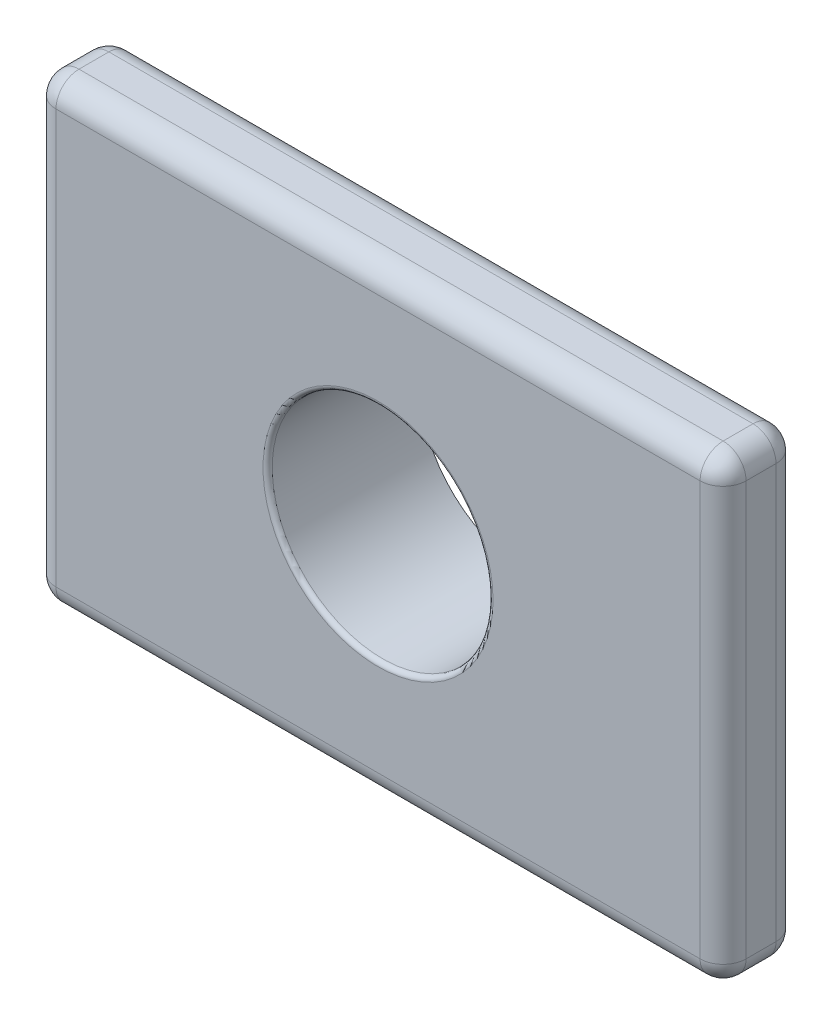
ISO-10303-21;
HEADER;
FILE_DESCRIPTION(('STEP AP214'),'2;1');
FILE_NAME('part.step','',(''),(''),'','','');
FILE_SCHEMA(('AUTOMOTIVE_DESIGN { 1 0 10303 214 1 1 1 1 }'));
ENDSEC;
DATA;
#1=APPLICATION_CONTEXT('core data for automotive mechanical design processes');
#2=APPLICATION_PROTOCOL_DEFINITION('international standard','automotive_design',2000,#1);
#3=PRODUCT_CONTEXT('',#1,'mechanical');
#4=PRODUCT('Part','Part','',(#3));
#5=PRODUCT_RELATED_PRODUCT_CATEGORY('part','',(#4));
#6=PRODUCT_DEFINITION_FORMATION('','',#4);
#7=PRODUCT_DEFINITION_CONTEXT('part definition',#1,'design');
#8=PRODUCT_DEFINITION('design','',#6,#7);
#9=PRODUCT_DEFINITION_SHAPE('','',#8);
#10=(LENGTH_UNIT() NAMED_UNIT(*) SI_UNIT(.MILLI.,.METRE.));
#11=(NAMED_UNIT(*) PLANE_ANGLE_UNIT() SI_UNIT($,.RADIAN.));
#12=(NAMED_UNIT(*) SI_UNIT($,.STERADIAN.) SOLID_ANGLE_UNIT());
#13=UNCERTAINTY_MEASURE_WITH_UNIT(LENGTH_MEASURE(1.E-05),#10,'distance_accuracy_value','');
#14=(GEOMETRIC_REPRESENTATION_CONTEXT(3) GLOBAL_UNCERTAINTY_ASSIGNED_CONTEXT((#13)) GLOBAL_UNIT_ASSIGNED_CONTEXT((#10,
#11,#12)) REPRESENTATION_CONTEXT('',''));
#15=CARTESIAN_POINT('',(0.,0.,0.));
#16=DIRECTION('',(0.,0.,1.));
#17=DIRECTION('',(1.,0.,0.));
#18=AXIS2_PLACEMENT_3D('',#15,#16,#17);
#19=CARTESIAN_POINT('',(0.,0.,0.));
#20=DIRECTION('',(0.,0.,1.));
#21=DIRECTION('',(1.,0.,0.));
#22=AXIS2_PLACEMENT_3D('',#19,#20,#21);
#23=PLANE('',#22);
#24=DIRECTION('',(0.,1.,0.));
#25=VECTOR('',#24,1.);
#26=CARTESIAN_POINT('',(14.5,0.,0.));
#27=LINE('',#26,#25);
#28=CARTESIAN_POINT('',(14.5,9.498,0.));
#29=VERTEX_POINT('',#28);
#30=CARTESIAN_POINT('',(14.5,0.5,0.));
#31=VERTEX_POINT('',#30);
#32=EDGE_CURVE('E284',#29,#31,#27,.F.);
#33=ORIENTED_EDGE('',*,*,#32,.T.);
#34=DIRECTION('',(1.,0.,0.));
#35=VECTOR('',#34,1.);
#36=CARTESIAN_POINT('',(0.,0.5,0.));
#37=LINE('',#36,#35);
#38=CARTESIAN_POINT('',(0.5,0.5,0.));
#39=VERTEX_POINT('',#38);
#40=EDGE_CURVE('E159',#31,#39,#37,.F.);
#41=ORIENTED_EDGE('',*,*,#40,.T.);
#42=DIRECTION('',(0.,1.,0.));
#43=VECTOR('',#42,1.);
#44=CARTESIAN_POINT('',(0.5,9.498,0.));
#45=LINE('',#44,#43);
#46=CARTESIAN_POINT('',(0.5,9.498,0.));
#47=VERTEX_POINT('',#46);
#48=EDGE_CURVE('E59',#39,#47,#45,.T.);
#49=ORIENTED_EDGE('',*,*,#48,.T.);
#50=DIRECTION('',(1.,0.,0.));
#51=VECTOR('',#50,1.);
#52=CARTESIAN_POINT('',(14.5,9.498,0.));
#53=LINE('',#52,#51);
#54=EDGE_CURVE('E286',#47,#29,#53,.T.);
#55=ORIENTED_EDGE('',*,*,#54,.T.);
#56=EDGE_LOOP('',(#33,#41,#49,#55));
#57=FACE_BOUND('',#56,.T.);
#58=CARTESIAN_POINT('',(7.5,4.999,0.));
#59=DIRECTION('',(0.,0.,1.));
#60=DIRECTION('',(1.,0.,0.));
#61=AXIS2_PLACEMENT_3D('',#58,#59,#60);
#62=CIRCLE('',#61,2.7);
#63=CARTESIAN_POINT('',(10.2,4.999,0.));
#64=VERTEX_POINT('',#63);
#65=EDGE_CURVE('E235',#64,#64,#62,.T.);
#66=ORIENTED_EDGE('',*,*,#65,.T.);
#67=EDGE_LOOP('',(#66));
#68=FACE_BOUND('',#67,.T.);
#69=ADVANCED_FACE('F34',(#57,#68),#23,.F.);
#70=CARTESIAN_POINT('',(0.,0.,1.65));
#71=DIRECTION('',(0.,1.,0.));
#72=DIRECTION('',(0.,0.,1.));
#73=AXIS2_PLACEMENT_3D('',#70,#71,#72);
#74=PLANE('',#73);
#75=DIRECTION('',(0.,0.,-1.));
#76=VECTOR('',#75,1.);
#77=CARTESIAN_POINT('',(14.5,0.,1.65));
#78=LINE('',#77,#76);
#79=CARTESIAN_POINT('',(14.5,0.,0.5));
#80=VERTEX_POINT('',#79);
#81=CARTESIAN_POINT('',(14.5,0.,1.15));
#82=VERTEX_POINT('',#81);
#83=EDGE_CURVE('E130',#80,#82,#78,.F.);
#84=ORIENTED_EDGE('',*,*,#83,.T.);
#85=DIRECTION('',(1.,0.,0.));
#86=VECTOR('',#85,1.);
#87=CARTESIAN_POINT('',(0.5,0.,1.15));
#88=LINE('',#87,#86);
#89=CARTESIAN_POINT('',(0.5,0.,1.15));
#90=VERTEX_POINT('',#89);
#91=EDGE_CURVE('E134',#82,#90,#88,.F.);
#92=ORIENTED_EDGE('',*,*,#91,.T.);
#93=DIRECTION('',(0.,0.,-1.));
#94=VECTOR('',#93,1.);
#95=CARTESIAN_POINT('',(0.5,0.,0.));
#96=LINE('',#95,#94);
#97=CARTESIAN_POINT('',(0.5,0.,0.5));
#98=VERTEX_POINT('',#97);
#99=EDGE_CURVE('E132',#90,#98,#96,.T.);
#100=ORIENTED_EDGE('',*,*,#99,.T.);
#101=DIRECTION('',(1.,0.,0.));
#102=VECTOR('',#101,1.);
#103=CARTESIAN_POINT('',(0.,0.,0.5));
#104=LINE('',#103,#102);
#105=EDGE_CURVE('E127',#98,#80,#104,.T.);
#106=ORIENTED_EDGE('',*,*,#105,.T.);
#107=EDGE_LOOP('',(#84,#92,#100,#106));
#108=FACE_BOUND('',#107,.T.);
#109=ADVANCED_FACE('F129',(#108),#74,.F.);
#110=CARTESIAN_POINT('',(15.,0.,1.65));
#111=DIRECTION('',(-1.,0.,0.));
#112=DIRECTION('',(0.,0.,1.));
#113=AXIS2_PLACEMENT_3D('',#110,#111,#112);
#114=PLANE('',#113);
#115=DIRECTION('',(0.,0.,-1.));
#116=VECTOR('',#115,1.);
#117=CARTESIAN_POINT('',(15.,9.498,1.65));
#118=LINE('',#117,#116);
#119=CARTESIAN_POINT('',(15.,9.498,0.5));
#120=VERTEX_POINT('',#119);
#121=CARTESIAN_POINT('',(15.,9.498,1.15));
#122=VERTEX_POINT('',#121);
#123=EDGE_CURVE('E246',#120,#122,#118,.F.);
#124=ORIENTED_EDGE('',*,*,#123,.T.);
#125=DIRECTION('',(0.,1.,0.));
#126=VECTOR('',#125,1.);
#127=CARTESIAN_POINT('',(15.,0.5,1.15));
#128=LINE('',#127,#126);
#129=CARTESIAN_POINT('',(15.,0.5,1.15));
#130=VERTEX_POINT('',#129);
#131=EDGE_CURVE('E11',#122,#130,#128,.F.);
#132=ORIENTED_EDGE('',*,*,#131,.T.);
#133=DIRECTION('',(0.,0.,-1.));
#134=VECTOR('',#133,1.);
#135=CARTESIAN_POINT('',(15.,0.5,1.65));
#136=LINE('',#135,#134);
#137=CARTESIAN_POINT('',(15.,0.5,0.5));
#138=VERTEX_POINT('',#137);
#139=EDGE_CURVE('E244',#130,#138,#136,.T.);
#140=ORIENTED_EDGE('',*,*,#139,.T.);
#141=DIRECTION('',(0.,1.,0.));
#142=VECTOR('',#141,1.);
#143=CARTESIAN_POINT('',(15.,0.,0.5));
#144=LINE('',#143,#142);
#145=EDGE_CURVE('E43',#138,#120,#144,.T.);
#146=ORIENTED_EDGE('',*,*,#145,.T.);
#147=EDGE_LOOP('',(#124,#132,#140,#146));
#148=FACE_BOUND('',#147,.T.);
#149=ADVANCED_FACE('F291',(#148),#114,.F.);
#150=CARTESIAN_POINT('',(0.,9.998,1.65));
#151=DIRECTION('',(0.,1.,0.));
#152=DIRECTION('',(0.,0.,1.));
#153=AXIS2_PLACEMENT_3D('',#150,#151,#152);
#154=PLANE('',#153);
#155=DIRECTION('',(0.,0.,-1.));
#156=VECTOR('',#155,1.);
#157=CARTESIAN_POINT('',(0.5,9.998,1.65));
#158=LINE('',#157,#156);
#159=CARTESIAN_POINT('',(0.5,9.998,0.5));
#160=VERTEX_POINT('',#159);
#161=CARTESIAN_POINT('',(0.5,9.998,1.15));
#162=VERTEX_POINT('',#161);
#163=EDGE_CURVE('E238',#160,#162,#158,.F.);
#164=ORIENTED_EDGE('',*,*,#163,.T.);
#165=DIRECTION('',(1.,0.,0.));
#166=VECTOR('',#165,1.);
#167=CARTESIAN_POINT('',(0.,9.998,1.15));
#168=LINE('',#167,#166);
#169=CARTESIAN_POINT('',(14.5,9.998,1.15));
#170=VERTEX_POINT('',#169);
#171=EDGE_CURVE('E278',#162,#170,#168,.T.);
#172=ORIENTED_EDGE('',*,*,#171,.T.);
#173=DIRECTION('',(0.,0.,-1.));
#174=VECTOR('',#173,1.);
#175=CARTESIAN_POINT('',(14.5,9.998,0.));
#176=LINE('',#175,#174);
#177=CARTESIAN_POINT('',(14.5,9.998,0.5));
#178=VERTEX_POINT('',#177);
#179=EDGE_CURVE('E241',#170,#178,#176,.T.);
#180=ORIENTED_EDGE('',*,*,#179,.T.);
#181=DIRECTION('',(1.,0.,0.));
#182=VECTOR('',#181,1.);
#183=CARTESIAN_POINT('',(0.5,9.998,0.5));
#184=LINE('',#183,#182);
#185=EDGE_CURVE('E276',#178,#160,#184,.F.);
#186=ORIENTED_EDGE('',*,*,#185,.T.);
#187=EDGE_LOOP('',(#164,#172,#180,#186));
#188=FACE_BOUND('',#187,.T.);
#189=ADVANCED_FACE('F309',(#188),#154,.T.);
#190=CARTESIAN_POINT('',(0.,0.,1.65));
#191=DIRECTION('',(-1.,0.,0.));
#192=DIRECTION('',(0.,0.,1.));
#193=AXIS2_PLACEMENT_3D('',#190,#191,#192);
#194=PLANE('',#193);
#195=DIRECTION('',(0.,0.,-1.));
#196=VECTOR('',#195,1.);
#197=CARTESIAN_POINT('',(0.,0.5,1.65));
#198=LINE('',#197,#196);
#199=CARTESIAN_POINT('',(0.,0.5,0.5));
#200=VERTEX_POINT('',#199);
#201=CARTESIAN_POINT('',(0.,0.5,1.15));
#202=VERTEX_POINT('',#201);
#203=EDGE_CURVE('E147',#200,#202,#198,.F.);
#204=ORIENTED_EDGE('',*,*,#203,.T.);
#205=DIRECTION('',(0.,1.,0.));
#206=VECTOR('',#205,1.);
#207=CARTESIAN_POINT('',(0.,0.,1.15));
#208=LINE('',#207,#206);
#209=CARTESIAN_POINT('',(0.,9.498,1.15));
#210=VERTEX_POINT('',#209);
#211=EDGE_CURVE('E270',#202,#210,#208,.T.);
#212=ORIENTED_EDGE('',*,*,#211,.T.);
#213=DIRECTION('',(0.,0.,-1.));
#214=VECTOR('',#213,1.);
#215=CARTESIAN_POINT('',(0.,9.498,1.65));
#216=LINE('',#215,#214);
#217=CARTESIAN_POINT('',(0.,9.498,0.5));
#218=VERTEX_POINT('',#217);
#219=EDGE_CURVE('E156',#210,#218,#216,.T.);
#220=ORIENTED_EDGE('',*,*,#219,.T.);
#221=DIRECTION('',(0.,1.,0.));
#222=VECTOR('',#221,1.);
#223=CARTESIAN_POINT('',(0.,0.5,0.5));
#224=LINE('',#223,#222);
#225=EDGE_CURVE('E268',#218,#200,#224,.F.);
#226=ORIENTED_EDGE('',*,*,#225,.T.);
#227=EDGE_LOOP('',(#204,#212,#220,#226));
#228=FACE_BOUND('',#227,.T.);
#229=ADVANCED_FACE('F321',(#228),#194,.T.);
#230=CARTESIAN_POINT('',(0.,0.,1.65));
#231=DIRECTION('',(0.,0.,1.));
#232=DIRECTION('',(1.,0.,0.));
#233=AXIS2_PLACEMENT_3D('',#230,#231,#232);
#234=PLANE('',#233);
#235=DIRECTION('',(0.,1.,0.));
#236=VECTOR('',#235,1.);
#237=CARTESIAN_POINT('',(0.5,0.,1.65));
#238=LINE('',#237,#236);
#239=CARTESIAN_POINT('',(0.5,9.498,1.65));
#240=VERTEX_POINT('',#239);
#241=CARTESIAN_POINT('',(0.5,0.5,1.65));
#242=VERTEX_POINT('',#241);
#243=EDGE_CURVE('E259',#240,#242,#238,.F.);
#244=ORIENTED_EDGE('',*,*,#243,.T.);
#245=DIRECTION('',(1.,0.,0.));
#246=VECTOR('',#245,1.);
#247=CARTESIAN_POINT('',(14.5,0.5,1.65));
#248=LINE('',#247,#246);
#249=CARTESIAN_POINT('',(14.5,0.5,1.65));
#250=VERTEX_POINT('',#249);
#251=EDGE_CURVE('E135',#242,#250,#248,.T.);
#252=ORIENTED_EDGE('',*,*,#251,.T.);
#253=DIRECTION('',(0.,1.,0.));
#254=VECTOR('',#253,1.);
#255=CARTESIAN_POINT('',(14.5,9.498,1.65));
#256=LINE('',#255,#254);
#257=CARTESIAN_POINT('',(14.5,9.498,1.65));
#258=VERTEX_POINT('',#257);
#259=EDGE_CURVE('E255',#250,#258,#256,.T.);
#260=ORIENTED_EDGE('',*,*,#259,.T.);
#261=DIRECTION('',(1.,0.,0.));
#262=VECTOR('',#261,1.);
#263=CARTESIAN_POINT('',(0.,9.498,1.65));
#264=LINE('',#263,#262);
#265=EDGE_CURVE('E257',#258,#240,#264,.F.);
#266=ORIENTED_EDGE('',*,*,#265,.T.);
#267=EDGE_LOOP('',(#244,#252,#260,#266));
#268=FACE_BOUND('',#267,.T.);
#269=CARTESIAN_POINT('',(7.5,4.999,1.65));
#270=DIRECTION('',(0.,0.,1.));
#271=DIRECTION('',(1.,0.,0.));
#272=AXIS2_PLACEMENT_3D('',#269,#270,#271);
#273=CIRCLE('',#272,2.5);
#274=CARTESIAN_POINT('',(10.,4.999,1.65));
#275=VERTEX_POINT('',#274);
#276=EDGE_CURVE('E221',#275,#275,#273,.F.);
#277=ORIENTED_EDGE('',*,*,#276,.T.);
#278=EDGE_LOOP('',(#277));
#279=FACE_BOUND('',#278,.T.);
#280=ADVANCED_FACE('F335',(#268,#279),#234,.T.);
#281=CARTESIAN_POINT('',(7.5,4.999,-1.65));
#282=DIRECTION('',(0.,0.,1.));
#283=DIRECTION('',(1.,0.,0.));
#284=AXIS2_PLACEMENT_3D('',#281,#282,#283);
#285=CYLINDRICAL_SURFACE('',#284,2.6);
#286=CARTESIAN_POINT('',(7.5,4.999,-1.55));
#287=DIRECTION('',(0.,0.,-1.));
#288=DIRECTION('',(-1.,0.,0.));
#289=AXIS2_PLACEMENT_3D('',#286,#287,#288);
#290=CIRCLE('',#289,2.6);
#291=CARTESIAN_POINT('',(4.9,4.999,-1.55));
#292=VERTEX_POINT('',#291);
#293=EDGE_CURVE('E232',#292,#292,#290,.F.);
#294=ORIENTED_EDGE('',*,*,#293,.T.);
#295=EDGE_LOOP('',(#294));
#296=FACE_BOUND('',#295,.T.);
#297=CARTESIAN_POINT('',(7.5,4.999,-0.1));
#298=DIRECTION('',(0.,0.,1.));
#299=DIRECTION('',(1.,0.,0.));
#300=AXIS2_PLACEMENT_3D('',#297,#298,#299);
#301=CIRCLE('',#300,2.6);
#302=CARTESIAN_POINT('',(10.1,4.999,-0.1));
#303=VERTEX_POINT('',#302);
#304=EDGE_CURVE('E229',#303,#303,#301,.F.);
#305=ORIENTED_EDGE('',*,*,#304,.T.);
#306=EDGE_LOOP('',(#305));
#307=FACE_BOUND('',#306,.T.);
#308=ADVANCED_FACE('F573',(#296,#307),#285,.T.);
#309=CARTESIAN_POINT('',(7.5,4.999,-1.65));
#310=DIRECTION('',(0.,0.,-1.));
#311=DIRECTION('',(-1.,0.,0.));
#312=AXIS2_PLACEMENT_3D('',#309,#310,#311);
#313=PLANE('',#312);
#314=CARTESIAN_POINT('',(7.5,4.999,-1.65));
#315=DIRECTION('',(0.,0.,-1.));
#316=DIRECTION('',(-1.,0.,0.));
#317=AXIS2_PLACEMENT_3D('',#314,#315,#316);
#318=CIRCLE('',#317,2.5);
#319=CARTESIAN_POINT('',(5.,4.999,-1.65));
#320=VERTEX_POINT('',#319);
#321=EDGE_CURVE('E226',#320,#320,#318,.T.);
#322=ORIENTED_EDGE('',*,*,#321,.T.);
#323=EDGE_LOOP('',(#322));
#324=FACE_BOUND('',#323,.T.);
#325=CARTESIAN_POINT('',(7.5,4.999,-1.65));
#326=DIRECTION('',(0.,0.,1.));
#327=DIRECTION('',(1.,0.,0.));
#328=AXIS2_PLACEMENT_3D('',#325,#326,#327);
#329=CIRCLE('',#328,2.4);
#330=CARTESIAN_POINT('',(9.9,4.999,-1.65));
#331=VERTEX_POINT('',#330);
#332=EDGE_CURVE('E211',#331,#331,#329,.T.);
#333=ORIENTED_EDGE('',*,*,#332,.T.);
#334=EDGE_LOOP('',(#333));
#335=FACE_BOUND('',#334,.T.);
#336=ADVANCED_FACE('F564',(#324,#335),#313,.T.);
#337=CARTESIAN_POINT('',(7.5,4.999,-1.65));
#338=DIRECTION('',(0.,0.,1.));
#339=DIRECTION('',(1.,0.,0.));
#340=AXIS2_PLACEMENT_3D('',#337,#338,#339);
#341=CYLINDRICAL_SURFACE('',#340,2.4);
#342=CARTESIAN_POINT('',(7.5,4.999,1.55));
#343=DIRECTION('',(0.,0.,1.));
#344=DIRECTION('',(1.,0.,0.));
#345=AXIS2_PLACEMENT_3D('',#342,#343,#344);
#346=CIRCLE('',#345,2.4);
#347=CARTESIAN_POINT('',(9.9,4.999,1.55));
#348=VERTEX_POINT('',#347);
#349=EDGE_CURVE('E216',#348,#348,#346,.T.);
#350=ORIENTED_EDGE('',*,*,#349,.T.);
#351=EDGE_LOOP('',(#350));
#352=FACE_BOUND('',#351,.T.);
#353=ORIENTED_EDGE('',*,*,#332,.F.);
#354=EDGE_LOOP('',(#353));
#355=FACE_BOUND('',#354,.T.);
#356=ADVANCED_FACE('F375',(#352,#355),#341,.F.);
#357=CARTESIAN_POINT('',(7.5,4.999,1.55));
#358=DIRECTION('',(0.,0.,1.));
#359=DIRECTION('',(1.,0.,0.));
#360=AXIS2_PLACEMENT_3D('',#357,#358,#359);
#361=TOROIDAL_SURFACE('',#360,2.5,0.1);
#362=ORIENTED_EDGE('',*,*,#276,.F.);
#363=EDGE_LOOP('',(#362));
#364=FACE_BOUND('',#363,.T.);
#365=ORIENTED_EDGE('',*,*,#349,.F.);
#366=EDGE_LOOP('',(#365));
#367=FACE_BOUND('',#366,.T.);
#368=ADVANCED_FACE('F371',(#364,#367),#361,.T.);
#369=CARTESIAN_POINT('',(7.5,4.999,-1.55));
#370=DIRECTION('',(0.,0.,-1.));
#371=DIRECTION('',(-1.,0.,0.));
#372=AXIS2_PLACEMENT_3D('',#369,#370,#371);
#373=TOROIDAL_SURFACE('',#372,2.5,0.1);
#374=ORIENTED_EDGE('',*,*,#293,.F.);
#375=EDGE_LOOP('',(#374));
#376=FACE_BOUND('',#375,.T.);
#377=ORIENTED_EDGE('',*,*,#321,.F.);
#378=EDGE_LOOP('',(#377));
#379=FACE_BOUND('',#378,.T.);
#380=ADVANCED_FACE('F374',(#376,#379),#373,.T.);
#381=CARTESIAN_POINT('',(7.5,4.999,-0.1));
#382=DIRECTION('',(0.,0.,1.));
#383=DIRECTION('',(1.,0.,0.));
#384=AXIS2_PLACEMENT_3D('',#381,#382,#383);
#385=TOROIDAL_SURFACE('',#384,2.7,0.1);
#386=ORIENTED_EDGE('',*,*,#65,.F.);
#387=EDGE_LOOP('',(#386));
#388=FACE_BOUND('',#387,.T.);
#389=ORIENTED_EDGE('',*,*,#304,.F.);
#390=EDGE_LOOP('',(#389));
#391=FACE_BOUND('',#390,.T.);
#392=ADVANCED_FACE('F379',(#388,#391),#385,.F.);
#393=CARTESIAN_POINT('',(14.5,9.498,1.65));
#394=DIRECTION('',(0.,0.,1.));
#395=DIRECTION('',(1.,0.,0.));
#396=AXIS2_PLACEMENT_3D('',#393,#394,#395);
#397=CYLINDRICAL_SURFACE('',#396,0.5);
#398=ORIENTED_EDGE('',*,*,#179,.F.);
#399=CARTESIAN_POINT('',(14.5,9.498,1.15));
#400=DIRECTION('',(0.,0.,1.));
#401=DIRECTION('',(1.,0.,0.));
#402=AXIS2_PLACEMENT_3D('',#399,#400,#401);
#403=CIRCLE('',#402,0.5);
#404=EDGE_CURVE('E282',#170,#122,#403,.F.);
#405=ORIENTED_EDGE('',*,*,#404,.T.);
#406=ORIENTED_EDGE('',*,*,#123,.F.);
#407=CARTESIAN_POINT('',(14.5,9.498,0.5));
#408=DIRECTION('',(0.,0.,1.));
#409=DIRECTION('',(1.,0.,0.));
#410=AXIS2_PLACEMENT_3D('',#407,#408,#409);
#411=CIRCLE('',#410,0.5);
#412=EDGE_CURVE('E280',#120,#178,#411,.T.);
#413=ORIENTED_EDGE('',*,*,#412,.T.);
#414=EDGE_LOOP('',(#398,#405,#406,#413));
#415=FACE_BOUND('',#414,.T.);
#416=ADVANCED_FACE('F297',(#415),#397,.T.);
#417=CARTESIAN_POINT('',(14.5,0.5,1.65));
#418=DIRECTION('',(0.,0.,-1.));
#419=DIRECTION('',(-1.,0.,0.));
#420=AXIS2_PLACEMENT_3D('',#417,#418,#419);
#421=CYLINDRICAL_SURFACE('',#420,0.5);
#422=ORIENTED_EDGE('',*,*,#139,.F.);
#423=CARTESIAN_POINT('',(14.5,0.5,1.15));
#424=DIRECTION('',(0.,0.,-1.));
#425=DIRECTION('',(-1.,0.,0.));
#426=AXIS2_PLACEMENT_3D('',#423,#424,#425);
#427=CIRCLE('',#426,0.5);
#428=EDGE_CURVE('E146',#130,#82,#427,.T.);
#429=ORIENTED_EDGE('',*,*,#428,.T.);
#430=ORIENTED_EDGE('',*,*,#83,.F.);
#431=CARTESIAN_POINT('',(14.5,0.5,0.5));
#432=DIRECTION('',(0.,0.,-1.));
#433=DIRECTION('',(-1.,0.,0.));
#434=AXIS2_PLACEMENT_3D('',#431,#432,#433);
#435=CIRCLE('',#434,0.5);
#436=EDGE_CURVE('E143',#80,#138,#435,.F.);
#437=ORIENTED_EDGE('',*,*,#436,.T.);
#438=EDGE_LOOP('',(#422,#429,#430,#437));
#439=FACE_BOUND('',#438,.T.);
#440=ADVANCED_FACE('F142',(#439),#421,.T.);
#441=CARTESIAN_POINT('',(0.5,9.498,1.65));
#442=DIRECTION('',(0.,0.,-1.));
#443=DIRECTION('',(-1.,0.,0.));
#444=AXIS2_PLACEMENT_3D('',#441,#442,#443);
#445=CYLINDRICAL_SURFACE('',#444,0.5);
#446=ORIENTED_EDGE('',*,*,#219,.F.);
#447=CARTESIAN_POINT('',(0.5,9.498,1.15));
#448=DIRECTION('',(0.,0.,-1.));
#449=DIRECTION('',(-1.,0.,0.));
#450=AXIS2_PLACEMENT_3D('',#447,#448,#449);
#451=CIRCLE('',#450,0.5);
#452=EDGE_CURVE('E274',#210,#162,#451,.T.);
#453=ORIENTED_EDGE('',*,*,#452,.T.);
#454=ORIENTED_EDGE('',*,*,#163,.F.);
#455=CARTESIAN_POINT('',(0.5,9.498,0.5));
#456=DIRECTION('',(0.,0.,-1.));
#457=DIRECTION('',(-1.,0.,0.));
#458=AXIS2_PLACEMENT_3D('',#455,#456,#457);
#459=CIRCLE('',#458,0.5);
#460=EDGE_CURVE('E272',#160,#218,#459,.F.);
#461=ORIENTED_EDGE('',*,*,#460,.T.);
#462=EDGE_LOOP('',(#446,#453,#454,#461));
#463=FACE_BOUND('',#462,.T.);
#464=ADVANCED_FACE('F313',(#463),#445,.T.);
#465=CARTESIAN_POINT('',(0.5,0.5,1.65));
#466=DIRECTION('',(0.,0.,1.));
#467=DIRECTION('',(1.,0.,0.));
#468=AXIS2_PLACEMENT_3D('',#465,#466,#467);
#469=CYLINDRICAL_SURFACE('',#468,0.5);
#470=ORIENTED_EDGE('',*,*,#99,.F.);
#471=CARTESIAN_POINT('',(0.5,0.5,1.15));
#472=DIRECTION('',(0.,0.,1.));
#473=DIRECTION('',(1.,0.,0.));
#474=AXIS2_PLACEMENT_3D('',#471,#472,#473);
#475=CIRCLE('',#474,0.5);
#476=EDGE_CURVE('E266',#90,#202,#475,.F.);
#477=ORIENTED_EDGE('',*,*,#476,.T.);
#478=ORIENTED_EDGE('',*,*,#203,.F.);
#479=CARTESIAN_POINT('',(0.5,0.5,0.5));
#480=DIRECTION('',(0.,0.,1.));
#481=DIRECTION('',(1.,0.,0.));
#482=AXIS2_PLACEMENT_3D('',#479,#480,#481);
#483=CIRCLE('',#482,0.5);
#484=EDGE_CURVE('E264',#200,#98,#483,.T.);
#485=ORIENTED_EDGE('',*,*,#484,.T.);
#486=EDGE_LOOP('',(#470,#477,#478,#485));
#487=FACE_BOUND('',#486,.T.);
#488=ADVANCED_FACE('F323',(#487),#469,.T.);
#489=CARTESIAN_POINT('',(0.5,9.498,1.15));
#490=DIRECTION('',(0.,0.,1.));
#491=DIRECTION('',(1.,0.,0.));
#492=AXIS2_PLACEMENT_3D('',#489,#490,#491);
#493=SPHERICAL_SURFACE('',#492,0.5);
#494=CARTESIAN_POINT('',(0.5,9.498,1.15));
#495=DIRECTION('',(1.,0.,0.));
#496=DIRECTION('',(0.,0.,-1.));
#497=AXIS2_PLACEMENT_3D('',#494,#495,#496);
#498=CIRCLE('',#497,0.5);
#499=EDGE_CURVE('E203',#162,#240,#498,.T.);
#500=ORIENTED_EDGE('',*,*,#499,.F.);
#501=ORIENTED_EDGE('',*,*,#452,.F.);
#502=CARTESIAN_POINT('',(0.5,9.498,1.15));
#503=DIRECTION('',(0.,-1.,0.));
#504=DIRECTION('',(0.,0.,-1.));
#505=AXIS2_PLACEMENT_3D('',#502,#503,#504);
#506=CIRCLE('',#505,0.5);
#507=EDGE_CURVE('E163',#240,#210,#506,.T.);
#508=ORIENTED_EDGE('',*,*,#507,.F.);
#509=EDGE_LOOP('',(#500,#501,#508));
#510=FACE_BOUND('',#509,.T.);
#511=ADVANCED_FACE('F339',(#510),#493,.T.);
#512=CARTESIAN_POINT('',(0.5,0.,1.15));
#513=DIRECTION('',(0.,1.,0.));
#514=DIRECTION('',(0.,0.,1.));
#515=AXIS2_PLACEMENT_3D('',#512,#513,#514);
#516=CYLINDRICAL_SURFACE('',#515,0.5);
#517=ORIENTED_EDGE('',*,*,#507,.T.);
#518=ORIENTED_EDGE('',*,*,#211,.F.);
#519=CARTESIAN_POINT('',(0.5,0.5,1.15));
#520=DIRECTION('',(0.,-1.,0.));
#521=DIRECTION('',(0.,0.,-1.));
#522=AXIS2_PLACEMENT_3D('',#519,#520,#521);
#523=CIRCLE('',#522,0.5);
#524=EDGE_CURVE('E201',#242,#202,#523,.T.);
#525=ORIENTED_EDGE('',*,*,#524,.F.);
#526=ORIENTED_EDGE('',*,*,#243,.F.);
#527=EDGE_LOOP('',(#517,#518,#525,#526));
#528=FACE_BOUND('',#527,.T.);
#529=ADVANCED_FACE('F337',(#528),#516,.T.);
#530=CARTESIAN_POINT('',(0.,9.498,1.15));
#531=DIRECTION('',(1.,0.,0.));
#532=DIRECTION('',(0.,0.,-1.));
#533=AXIS2_PLACEMENT_3D('',#530,#531,#532);
#534=CYLINDRICAL_SURFACE('',#533,0.5);
#535=ORIENTED_EDGE('',*,*,#499,.T.);
#536=ORIENTED_EDGE('',*,*,#265,.F.);
#537=CARTESIAN_POINT('',(14.5,9.498,1.15));
#538=DIRECTION('',(1.,0.,0.));
#539=DIRECTION('',(0.,0.,-1.));
#540=AXIS2_PLACEMENT_3D('',#537,#538,#539);
#541=CIRCLE('',#540,0.5);
#542=EDGE_CURVE('E198',#170,#258,#541,.T.);
#543=ORIENTED_EDGE('',*,*,#542,.F.);
#544=ORIENTED_EDGE('',*,*,#171,.F.);
#545=EDGE_LOOP('',(#535,#536,#543,#544));
#546=FACE_BOUND('',#545,.T.);
#547=ADVANCED_FACE('F341',(#546),#534,.T.);
#548=CARTESIAN_POINT('',(0.5,0.5,1.15));
#549=DIRECTION('',(0.,0.,1.));
#550=DIRECTION('',(1.,0.,0.));
#551=AXIS2_PLACEMENT_3D('',#548,#549,#550);
#552=SPHERICAL_SURFACE('',#551,0.5);
#553=ORIENTED_EDGE('',*,*,#524,.T.);
#554=ORIENTED_EDGE('',*,*,#476,.F.);
#555=CARTESIAN_POINT('',(0.5,0.5,1.15));
#556=DIRECTION('',(1.,0.,0.));
#557=DIRECTION('',(0.,0.,-1.));
#558=AXIS2_PLACEMENT_3D('',#555,#556,#557);
#559=CIRCLE('',#558,0.5);
#560=EDGE_CURVE('E195',#242,#90,#559,.T.);
#561=ORIENTED_EDGE('',*,*,#560,.F.);
#562=EDGE_LOOP('',(#553,#554,#561));
#563=FACE_BOUND('',#562,.T.);
#564=ADVANCED_FACE('F327',(#563),#552,.T.);
#565=CARTESIAN_POINT('',(14.5,9.498,1.15));
#566=DIRECTION('',(0.,0.,1.));
#567=DIRECTION('',(1.,0.,0.));
#568=AXIS2_PLACEMENT_3D('',#565,#566,#567);
#569=SPHERICAL_SURFACE('',#568,0.5);
#570=ORIENTED_EDGE('',*,*,#404,.F.);
#571=ORIENTED_EDGE('',*,*,#542,.T.);
#572=CARTESIAN_POINT('',(14.5,9.498,1.15));
#573=DIRECTION('',(0.,-1.,0.));
#574=DIRECTION('',(0.,0.,-1.));
#575=AXIS2_PLACEMENT_3D('',#572,#573,#574);
#576=CIRCLE('',#575,0.5);
#577=EDGE_CURVE('E189',#122,#258,#576,.T.);
#578=ORIENTED_EDGE('',*,*,#577,.F.);
#579=EDGE_LOOP('',(#570,#571,#578));
#580=FACE_BOUND('',#579,.T.);
#581=ADVANCED_FACE('F343',(#580),#569,.T.);
#582=CARTESIAN_POINT('',(0.,0.5,1.15));
#583=DIRECTION('',(-1.,0.,0.));
#584=DIRECTION('',(0.,0.,1.));
#585=AXIS2_PLACEMENT_3D('',#582,#583,#584);
#586=CYLINDRICAL_SURFACE('',#585,0.5);
#587=ORIENTED_EDGE('',*,*,#560,.T.);
#588=ORIENTED_EDGE('',*,*,#91,.F.);
#589=CARTESIAN_POINT('',(14.5,0.5,1.15));
#590=DIRECTION('',(1.,0.,0.));
#591=DIRECTION('',(0.,0.,-1.));
#592=AXIS2_PLACEMENT_3D('',#589,#590,#591);
#593=CIRCLE('',#592,0.5);
#594=EDGE_CURVE('E184',#250,#82,#593,.T.);
#595=ORIENTED_EDGE('',*,*,#594,.F.);
#596=ORIENTED_EDGE('',*,*,#251,.F.);
#597=EDGE_LOOP('',(#587,#588,#595,#596));
#598=FACE_BOUND('',#597,.T.);
#599=ADVANCED_FACE('F332',(#598),#586,.T.);
#600=CARTESIAN_POINT('',(14.5,0.,1.15));
#601=DIRECTION('',(0.,-1.,0.));
#602=DIRECTION('',(0.,0.,-1.));
#603=AXIS2_PLACEMENT_3D('',#600,#601,#602);
#604=CYLINDRICAL_SURFACE('',#603,0.5);
#605=ORIENTED_EDGE('',*,*,#577,.T.);
#606=ORIENTED_EDGE('',*,*,#259,.F.);
#607=CARTESIAN_POINT('',(14.5,0.5,1.15));
#608=DIRECTION('',(0.,-1.,0.));
#609=DIRECTION('',(0.,0.,-1.));
#610=AXIS2_PLACEMENT_3D('',#607,#608,#609);
#611=CIRCLE('',#610,0.5);
#612=EDGE_CURVE('E180',#130,#250,#611,.T.);
#613=ORIENTED_EDGE('',*,*,#612,.F.);
#614=ORIENTED_EDGE('',*,*,#131,.F.);
#615=EDGE_LOOP('',(#605,#606,#613,#614));
#616=FACE_BOUND('',#615,.T.);
#617=ADVANCED_FACE('F346',(#616),#604,.T.);
#618=CARTESIAN_POINT('',(14.5,0.5,1.15));
#619=DIRECTION('',(0.,0.,1.));
#620=DIRECTION('',(1.,0.,0.));
#621=AXIS2_PLACEMENT_3D('',#618,#619,#620);
#622=SPHERICAL_SURFACE('',#621,0.5);
#623=ORIENTED_EDGE('',*,*,#594,.T.);
#624=ORIENTED_EDGE('',*,*,#428,.F.);
#625=ORIENTED_EDGE('',*,*,#612,.T.);
#626=EDGE_LOOP('',(#623,#624,#625));
#627=FACE_BOUND('',#626,.T.);
#628=ADVANCED_FACE('F347',(#627),#622,.T.);
#629=CARTESIAN_POINT('',(0.5,9.498,0.5));
#630=DIRECTION('',(0.,0.,1.));
#631=DIRECTION('',(1.,0.,0.));
#632=AXIS2_PLACEMENT_3D('',#629,#630,#631);
#633=SPHERICAL_SURFACE('',#632,0.5);
#634=CARTESIAN_POINT('',(0.5,9.498,0.5));
#635=DIRECTION('',(0.,-1.,0.));
#636=DIRECTION('',(0.,0.,-1.));
#637=AXIS2_PLACEMENT_3D('',#634,#635,#636);
#638=CIRCLE('',#637,0.5);
#639=EDGE_CURVE('E174',#218,#47,#638,.T.);
#640=ORIENTED_EDGE('',*,*,#639,.F.);
#641=ORIENTED_EDGE('',*,*,#460,.F.);
#642=CARTESIAN_POINT('',(0.5,9.498,0.5));
#643=DIRECTION('',(1.,0.,0.));
#644=DIRECTION('',(0.,0.,-1.));
#645=AXIS2_PLACEMENT_3D('',#642,#643,#644);
#646=CIRCLE('',#645,0.5);
#647=EDGE_CURVE('E38',#47,#160,#646,.T.);
#648=ORIENTED_EDGE('',*,*,#647,.F.);
#649=EDGE_LOOP('',(#640,#641,#648));
#650=FACE_BOUND('',#649,.T.);
#651=ADVANCED_FACE('F36',(#650),#633,.T.);
#652=CARTESIAN_POINT('',(0.,9.498,0.5));
#653=DIRECTION('',(-1.,0.,0.));
#654=DIRECTION('',(0.,0.,1.));
#655=AXIS2_PLACEMENT_3D('',#652,#653,#654);
#656=CYLINDRICAL_SURFACE('',#655,0.5);
#657=ORIENTED_EDGE('',*,*,#647,.T.);
#658=ORIENTED_EDGE('',*,*,#185,.F.);
#659=CARTESIAN_POINT('',(14.5,9.498,0.5));
#660=DIRECTION('',(1.,0.,0.));
#661=DIRECTION('',(0.,0.,-1.));
#662=AXIS2_PLACEMENT_3D('',#659,#660,#661);
#663=CIRCLE('',#662,0.5);
#664=EDGE_CURVE('E172',#29,#178,#663,.T.);
#665=ORIENTED_EDGE('',*,*,#664,.F.);
#666=ORIENTED_EDGE('',*,*,#54,.F.);
#667=EDGE_LOOP('',(#657,#658,#665,#666));
#668=FACE_BOUND('',#667,.T.);
#669=ADVANCED_FACE('F306',(#668),#656,.T.);
#670=CARTESIAN_POINT('',(0.5,0.,0.5));
#671=DIRECTION('',(0.,-1.,0.));
#672=DIRECTION('',(0.,0.,-1.));
#673=AXIS2_PLACEMENT_3D('',#670,#671,#672);
#674=CYLINDRICAL_SURFACE('',#673,0.5);
#675=ORIENTED_EDGE('',*,*,#639,.T.);
#676=ORIENTED_EDGE('',*,*,#48,.F.);
#677=CARTESIAN_POINT('',(0.5,0.5,0.5));
#678=DIRECTION('',(0.,-1.,0.));
#679=DIRECTION('',(0.,0.,-1.));
#680=AXIS2_PLACEMENT_3D('',#677,#678,#679);
#681=CIRCLE('',#680,0.5);
#682=EDGE_CURVE('E170',#200,#39,#681,.T.);
#683=ORIENTED_EDGE('',*,*,#682,.F.);
#684=ORIENTED_EDGE('',*,*,#225,.F.);
#685=EDGE_LOOP('',(#675,#676,#683,#684));
#686=FACE_BOUND('',#685,.T.);
#687=ADVANCED_FACE('F317',(#686),#674,.T.);
#688=CARTESIAN_POINT('',(14.5,9.498,0.5));
#689=DIRECTION('',(0.,0.,1.));
#690=DIRECTION('',(1.,0.,0.));
#691=AXIS2_PLACEMENT_3D('',#688,#689,#690);
#692=SPHERICAL_SURFACE('',#691,0.5);
#693=ORIENTED_EDGE('',*,*,#664,.T.);
#694=ORIENTED_EDGE('',*,*,#412,.F.);
#695=CARTESIAN_POINT('',(14.5,9.498,0.5));
#696=DIRECTION('',(0.,-1.,0.));
#697=DIRECTION('',(0.,0.,-1.));
#698=AXIS2_PLACEMENT_3D('',#695,#696,#697);
#699=CIRCLE('',#698,0.5);
#700=EDGE_CURVE('E167',#29,#120,#699,.T.);
#701=ORIENTED_EDGE('',*,*,#700,.F.);
#702=EDGE_LOOP('',(#693,#694,#701));
#703=FACE_BOUND('',#702,.T.);
#704=ADVANCED_FACE('F301',(#703),#692,.T.);
#705=CARTESIAN_POINT('',(0.5,0.5,0.5));
#706=DIRECTION('',(0.,0.,1.));
#707=DIRECTION('',(1.,0.,0.));
#708=AXIS2_PLACEMENT_3D('',#705,#706,#707);
#709=SPHERICAL_SURFACE('',#708,0.5);
#710=ORIENTED_EDGE('',*,*,#484,.F.);
#711=ORIENTED_EDGE('',*,*,#682,.T.);
#712=CARTESIAN_POINT('',(0.5,0.5,0.5));
#713=DIRECTION('',(1.,0.,0.));
#714=DIRECTION('',(0.,0.,-1.));
#715=AXIS2_PLACEMENT_3D('',#712,#713,#714);
#716=CIRCLE('',#715,0.5);
#717=EDGE_CURVE('E51',#98,#39,#716,.T.);
#718=ORIENTED_EDGE('',*,*,#717,.F.);
#719=EDGE_LOOP('',(#710,#711,#718));
#720=FACE_BOUND('',#719,.T.);
#721=ADVANCED_FACE('F406',(#720),#709,.T.);
#722=CARTESIAN_POINT('',(14.5,0.,0.5));
#723=DIRECTION('',(0.,1.,0.));
#724=DIRECTION('',(0.,0.,1.));
#725=AXIS2_PLACEMENT_3D('',#722,#723,#724);
#726=CYLINDRICAL_SURFACE('',#725,0.5);
#727=ORIENTED_EDGE('',*,*,#700,.T.);
#728=ORIENTED_EDGE('',*,*,#145,.F.);
#729=CARTESIAN_POINT('',(14.5,0.5,0.5));
#730=DIRECTION('',(0.,-1.,0.));
#731=DIRECTION('',(0.,0.,-1.));
#732=AXIS2_PLACEMENT_3D('',#729,#730,#731);
#733=CIRCLE('',#732,0.5);
#734=EDGE_CURVE('E154',#31,#138,#733,.T.);
#735=ORIENTED_EDGE('',*,*,#734,.F.);
#736=ORIENTED_EDGE('',*,*,#32,.F.);
#737=EDGE_LOOP('',(#727,#728,#735,#736));
#738=FACE_BOUND('',#737,.T.);
#739=ADVANCED_FACE('F304',(#738),#726,.T.);
#740=CARTESIAN_POINT('',(0.,0.5,0.5));
#741=DIRECTION('',(1.,0.,0.));
#742=DIRECTION('',(0.,0.,-1.));
#743=AXIS2_PLACEMENT_3D('',#740,#741,#742);
#744=CYLINDRICAL_SURFACE('',#743,0.5);
#745=ORIENTED_EDGE('',*,*,#717,.T.);
#746=ORIENTED_EDGE('',*,*,#40,.F.);
#747=CARTESIAN_POINT('',(14.5,0.5,0.5));
#748=DIRECTION('',(1.,0.,0.));
#749=DIRECTION('',(0.,0.,-1.));
#750=AXIS2_PLACEMENT_3D('',#747,#748,#749);
#751=CIRCLE('',#750,0.5);
#752=EDGE_CURVE('E152',#80,#31,#751,.T.);
#753=ORIENTED_EDGE('',*,*,#752,.F.);
#754=ORIENTED_EDGE('',*,*,#105,.F.);
#755=EDGE_LOOP('',(#745,#746,#753,#754));
#756=FACE_BOUND('',#755,.T.);
#757=ADVANCED_FACE('F158',(#756),#744,.T.);
#758=CARTESIAN_POINT('',(14.5,0.5,0.5));
#759=DIRECTION('',(0.,0.,1.));
#760=DIRECTION('',(1.,0.,0.));
#761=AXIS2_PLACEMENT_3D('',#758,#759,#760);
#762=SPHERICAL_SURFACE('',#761,0.5);
#763=ORIENTED_EDGE('',*,*,#734,.T.);
#764=ORIENTED_EDGE('',*,*,#436,.F.);
#765=ORIENTED_EDGE('',*,*,#752,.T.);
#766=EDGE_LOOP('',(#763,#764,#765));
#767=FACE_BOUND('',#766,.T.);
#768=ADVANCED_FACE('F151',(#767),#762,.T.);
#769=CLOSED_SHELL('',(#69,#109,#149,#189,#229,#280,#308,#336,#356,#368,#380,#392,#416,#440,#464,
#488,#511,#529,#547,#564,#581,#599,#617,#628,#651,#669,#687,#704,#721,#739,#757,#768));
#770=MANIFOLD_SOLID_BREP('B2',#769);
#771=ADVANCED_BREP_SHAPE_REPRESENTATION('',(#18,#770),#14);
#772=SHAPE_DEFINITION_REPRESENTATION(#9,#771);
ENDSEC;
END-ISO-10303-21;
